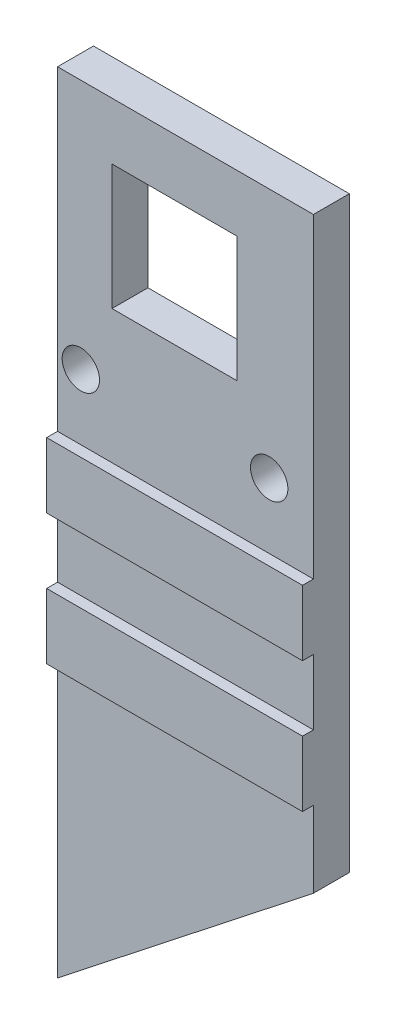
ISO-10303-21;
HEADER;
FILE_DESCRIPTION(('STEP AP214'),'2;1');
FILE_NAME('part.step','',(''),(''),'','','');
FILE_SCHEMA(('AUTOMOTIVE_DESIGN { 1 0 10303 214 1 1 1 1 }'));
ENDSEC;
DATA;
#1=APPLICATION_CONTEXT('core data for automotive mechanical design processes');
#2=APPLICATION_PROTOCOL_DEFINITION('international standard','automotive_design',2000,#1);
#3=PRODUCT_CONTEXT('',#1,'mechanical');
#4=PRODUCT('Part','Part','',(#3));
#5=PRODUCT_RELATED_PRODUCT_CATEGORY('part','',(#4));
#6=PRODUCT_DEFINITION_FORMATION('','',#4);
#7=PRODUCT_DEFINITION_CONTEXT('part definition',#1,'design');
#8=PRODUCT_DEFINITION('design','',#6,#7);
#9=PRODUCT_DEFINITION_SHAPE('','',#8);
#10=(LENGTH_UNIT() NAMED_UNIT(*) SI_UNIT(.MILLI.,.METRE.));
#11=(NAMED_UNIT(*) PLANE_ANGLE_UNIT() SI_UNIT($,.RADIAN.));
#12=(NAMED_UNIT(*) SI_UNIT($,.STERADIAN.) SOLID_ANGLE_UNIT());
#13=UNCERTAINTY_MEASURE_WITH_UNIT(LENGTH_MEASURE(1.E-05),#10,'distance_accuracy_value','');
#14=(GEOMETRIC_REPRESENTATION_CONTEXT(3) GLOBAL_UNCERTAINTY_ASSIGNED_CONTEXT((#13)) GLOBAL_UNIT_ASSIGNED_CONTEXT((#10,
#11,#12)) REPRESENTATION_CONTEXT('',''));
#15=CARTESIAN_POINT('',(0.,0.,0.));
#16=DIRECTION('',(0.,0.,1.));
#17=DIRECTION('',(1.,0.,0.));
#18=AXIS2_PLACEMENT_3D('',#15,#16,#17);
#19=CARTESIAN_POINT('',(0.,0.,3.3));
#20=DIRECTION('',(0.,0.,1.));
#21=DIRECTION('',(1.,0.,0.));
#22=AXIS2_PLACEMENT_3D('',#19,#20,#21);
#23=PLANE('',#22);
#24=DIRECTION('',(0.,1.,0.));
#25=VECTOR('',#24,1.);
#26=CARTESIAN_POINT('',(-10.7877192602988,0.,3.3));
#27=LINE('',#26,#25);
#28=CARTESIAN_POINT('',(-10.7877192602988,-39.3203194861106,3.3));
#29=VERTEX_POINT('',#28);
#30=CARTESIAN_POINT('',(-10.7877192602988,-13.8338220830736,3.3));
#31=VERTEX_POINT('',#30);
#32=EDGE_CURVE('E291',#29,#31,#27,.T.);
#33=ORIENTED_EDGE('',*,*,#32,.F.);
#34=DIRECTION('',(0.785948961590541,0.618291379346947,0.));
#35=VECTOR('',#34,1.);
#36=CARTESIAN_POINT('',(-15.2539528353899,-42.8338220830736,3.3));
#37=LINE('',#36,#35);
#38=CARTESIAN_POINT('',(12.7122807397012,-20.8333080836795,3.3));
#39=VERTEX_POINT('',#38);
#40=EDGE_CURVE('E251',#29,#39,#37,.T.);
#41=ORIENTED_EDGE('',*,*,#40,.T.);
#42=DIRECTION('',(0.,-1.,0.));
#43=VECTOR('',#42,1.);
#44=CARTESIAN_POINT('',(12.7122807397012,0.,3.3));
#45=LINE('',#44,#43);
#46=CARTESIAN_POINT('',(12.7122807397012,-13.8338220830736,3.3));
#47=VERTEX_POINT('',#46);
#48=EDGE_CURVE('E61',#47,#39,#45,.T.);
#49=ORIENTED_EDGE('',*,*,#48,.F.);
#50=DIRECTION('',(1.,0.,0.));
#51=VECTOR('',#50,1.);
#52=CARTESIAN_POINT('',(-15.2539528353899,-13.8338220830736,3.3));
#53=LINE('',#52,#51);
#54=EDGE_CURVE('E188',#31,#47,#53,.T.);
#55=ORIENTED_EDGE('',*,*,#54,.F.);
#56=EDGE_LOOP('',(#33,#41,#49,#55));
#57=FACE_BOUND('',#56,.T.);
#58=ADVANCED_FACE('F39',(#57),#23,.T.);
#59=CARTESIAN_POINT('',(0.,0.,0.));
#60=DIRECTION('',(0.,0.,1.));
#61=DIRECTION('',(1.,0.,0.));
#62=AXIS2_PLACEMENT_3D('',#59,#60,#61);
#63=PLANE('',#62);
#64=DIRECTION('',(1.,0.,0.));
#65=VECTOR('',#64,1.);
#66=CARTESIAN_POINT('',(0.,27.9318613374807,0.));
#67=LINE('',#66,#65);
#68=CARTESIAN_POINT('',(-5.78771926029876,27.9318613374807,0.));
#69=VERTEX_POINT('',#68);
#70=CARTESIAN_POINT('',(5.71228073970124,27.9318613374807,0.));
#71=VERTEX_POINT('',#70);
#72=EDGE_CURVE('E176',#69,#71,#67,.T.);
#73=ORIENTED_EDGE('',*,*,#72,.F.);
#74=DIRECTION('',(0.,-1.,0.));
#75=VECTOR('',#74,1.);
#76=CARTESIAN_POINT('',(-5.78771926029876,0.,0.));
#77=LINE('',#76,#75);
#78=CARTESIAN_POINT('',(-5.78771926029876,16.4318613374807,0.));
#79=VERTEX_POINT('',#78);
#80=EDGE_CURVE('E217',#69,#79,#77,.T.);
#81=ORIENTED_EDGE('',*,*,#80,.T.);
#82=DIRECTION('',(1.,0.,0.));
#83=VECTOR('',#82,1.);
#84=CARTESIAN_POINT('',(0.,16.4318613374807,0.));
#85=LINE('',#84,#83);
#86=CARTESIAN_POINT('',(5.71228073970124,16.4318613374807,0.));
#87=VERTEX_POINT('',#86);
#88=EDGE_CURVE('E214',#79,#87,#85,.T.);
#89=ORIENTED_EDGE('',*,*,#88,.T.);
#90=DIRECTION('',(0.,-1.,0.));
#91=VECTOR('',#90,1.);
#92=CARTESIAN_POINT('',(5.71228073970124,0.,0.));
#93=LINE('',#92,#91);
#94=EDGE_CURVE('E179',#71,#87,#93,.T.);
#95=ORIENTED_EDGE('',*,*,#94,.F.);
#96=EDGE_LOOP('',(#73,#81,#89,#95));
#97=FACE_BOUND('',#96,.T.);
#98=CARTESIAN_POINT('',(-8.65,10.1661779169264,0.));
#99=DIRECTION('',(0.,0.,1.));
#100=DIRECTION('',(1.,0.,0.));
#101=AXIS2_PLACEMENT_3D('',#98,#99,#100);
#102=CIRCLE('',#101,1.71606969398137);
#103=CARTESIAN_POINT('',(-6.93393030601863,10.1661779169264,0.));
#104=VERTEX_POINT('',#103);
#105=EDGE_CURVE('E223',#104,#104,#102,.T.);
#106=ORIENTED_EDGE('',*,*,#105,.T.);
#107=EDGE_LOOP('',(#106));
#108=FACE_BOUND('',#107,.T.);
#109=CARTESIAN_POINT('',(8.65,10.1661779169264,0.));
#110=DIRECTION('',(0.,0.,1.));
#111=DIRECTION('',(1.,0.,0.));
#112=AXIS2_PLACEMENT_3D('',#109,#110,#111);
#113=CIRCLE('',#112,1.71606969398137);
#114=CARTESIAN_POINT('',(10.3660696939814,10.1661779169264,0.));
#115=VERTEX_POINT('',#114);
#116=EDGE_CURVE('E194',#115,#115,#113,.F.);
#117=ORIENTED_EDGE('',*,*,#116,.F.);
#118=EDGE_LOOP('',(#117));
#119=FACE_BOUND('',#118,.T.);
#120=DIRECTION('',(0.785948961590541,0.618291379346947,0.));
#121=VECTOR('',#120,1.);
#122=CARTESIAN_POINT('',(-15.2539528353899,-42.8338220830736,0.));
#123=LINE('',#122,#121);
#124=CARTESIAN_POINT('',(-10.7877192602988,-39.3203194861106,0.));
#125=VERTEX_POINT('',#124);
#126=CARTESIAN_POINT('',(12.7122807397012,-20.8333080836795,0.));
#127=VERTEX_POINT('',#126);
#128=EDGE_CURVE('E245',#125,#127,#123,.T.);
#129=ORIENTED_EDGE('',*,*,#128,.F.);
#130=DIRECTION('',(0.,1.,0.));
#131=VECTOR('',#130,1.);
#132=CARTESIAN_POINT('',(-10.7877192602988,0.,0.));
#133=LINE('',#132,#131);
#134=CARTESIAN_POINT('',(-10.7877192602988,33.1661779169264,0.));
#135=VERTEX_POINT('',#134);
#136=EDGE_CURVE('E53',#125,#135,#133,.T.);
#137=ORIENTED_EDGE('',*,*,#136,.T.);
#138=DIRECTION('',(1.,0.,0.));
#139=VECTOR('',#138,1.);
#140=CARTESIAN_POINT('',(0.,33.1661779169264,0.));
#141=LINE('',#140,#139);
#142=CARTESIAN_POINT('',(12.7122807397012,33.1661779169264,0.));
#143=VERTEX_POINT('',#142);
#144=EDGE_CURVE('E220',#135,#143,#141,.T.);
#145=ORIENTED_EDGE('',*,*,#144,.T.);
#146=DIRECTION('',(0.,-1.,0.));
#147=VECTOR('',#146,1.);
#148=CARTESIAN_POINT('',(12.7122807397012,0.,0.));
#149=LINE('',#148,#147);
#150=EDGE_CURVE('E236',#143,#127,#149,.T.);
#151=ORIENTED_EDGE('',*,*,#150,.T.);
#152=EDGE_LOOP('',(#129,#137,#145,#151));
#153=FACE_BOUND('',#152,.T.);
#154=ADVANCED_FACE('F244',(#97,#108,#119,#153),#63,.F.);
#155=DIRECTION('',(0.,1.,0.));
#156=VECTOR('',#155,1.);
#157=CARTESIAN_POINT('',(-10.7877192602988,0.,3.3));
#158=LINE('',#157,#156);
#159=CARTESIAN_POINT('',(-10.7877192602988,-7.83382208307362,3.3));
#160=VERTEX_POINT('',#159);
#161=CARTESIAN_POINT('',(-10.7877192602988,-1.83382208307362,3.3));
#162=VERTEX_POINT('',#161);
#163=EDGE_CURVE('E297',#160,#162,#158,.T.);
#164=ORIENTED_EDGE('',*,*,#163,.F.);
#165=DIRECTION('',(-1.,0.,0.));
#166=VECTOR('',#165,1.);
#167=CARTESIAN_POINT('',(-15.2539528353899,-7.83382208307362,3.3));
#168=LINE('',#167,#166);
#169=CARTESIAN_POINT('',(12.7122807397012,-7.83382208307362,3.3));
#170=VERTEX_POINT('',#169);
#171=EDGE_CURVE('E261',#170,#160,#168,.T.);
#172=ORIENTED_EDGE('',*,*,#171,.F.);
#173=DIRECTION('',(0.,-1.,0.));
#174=VECTOR('',#173,1.);
#175=CARTESIAN_POINT('',(12.7122807397012,0.,3.3));
#176=LINE('',#175,#174);
#177=CARTESIAN_POINT('',(12.7122807397012,-1.83382208307362,3.3));
#178=VERTEX_POINT('',#177);
#179=EDGE_CURVE('E283',#178,#170,#176,.T.);
#180=ORIENTED_EDGE('',*,*,#179,.F.);
#181=DIRECTION('',(1.,0.,0.));
#182=VECTOR('',#181,1.);
#183=CARTESIAN_POINT('',(-15.2539528353899,-1.83382208307362,3.3));
#184=LINE('',#183,#182);
#185=EDGE_CURVE('E185',#162,#178,#184,.T.);
#186=ORIENTED_EDGE('',*,*,#185,.F.);
#187=EDGE_LOOP('',(#164,#172,#180,#186));
#188=FACE_BOUND('',#187,.T.);
#189=ADVANCED_FACE('F312',(#188),#23,.T.);
#190=DIRECTION('',(0.,1.,0.));
#191=VECTOR('',#190,1.);
#192=CARTESIAN_POINT('',(-10.7877192602988,0.,3.3));
#193=LINE('',#192,#191);
#194=CARTESIAN_POINT('',(-10.7877192602988,4.16617791692638,3.3));
#195=VERTEX_POINT('',#194);
#196=CARTESIAN_POINT('',(-10.7877192602988,33.1661779169264,3.3));
#197=VERTEX_POINT('',#196);
#198=EDGE_CURVE('E256',#195,#197,#193,.T.);
#199=ORIENTED_EDGE('',*,*,#198,.F.);
#200=DIRECTION('',(-1.,0.,0.));
#201=VECTOR('',#200,1.);
#202=CARTESIAN_POINT('',(-15.2539528353899,4.16617791692638,3.3));
#203=LINE('',#202,#201);
#204=CARTESIAN_POINT('',(12.7122807397012,4.16617791692637,3.3));
#205=VERTEX_POINT('',#204);
#206=EDGE_CURVE('E181',#205,#195,#203,.T.);
#207=ORIENTED_EDGE('',*,*,#206,.F.);
#208=DIRECTION('',(0.,-1.,0.));
#209=VECTOR('',#208,1.);
#210=CARTESIAN_POINT('',(12.7122807397012,0.,3.3));
#211=LINE('',#210,#209);
#212=CARTESIAN_POINT('',(12.7122807397012,33.1661779169264,3.3));
#213=VERTEX_POINT('',#212);
#214=EDGE_CURVE('E155',#213,#205,#211,.T.);
#215=ORIENTED_EDGE('',*,*,#214,.F.);
#216=DIRECTION('',(1.,0.,0.));
#217=VECTOR('',#216,1.);
#218=CARTESIAN_POINT('',(0.,33.1661779169264,3.3));
#219=LINE('',#218,#217);
#220=EDGE_CURVE('E202',#197,#213,#219,.T.);
#221=ORIENTED_EDGE('',*,*,#220,.F.);
#222=EDGE_LOOP('',(#199,#207,#215,#221));
#223=FACE_BOUND('',#222,.T.);
#224=CARTESIAN_POINT('',(8.65,10.1661779169264,3.3));
#225=DIRECTION('',(0.,0.,1.));
#226=DIRECTION('',(1.,0.,0.));
#227=AXIS2_PLACEMENT_3D('',#224,#225,#226);
#228=CIRCLE('',#227,1.71606969398137);
#229=CARTESIAN_POINT('',(10.3660696939814,10.1661779169264,3.3));
#230=VERTEX_POINT('',#229);
#231=EDGE_CURVE('E208',#230,#230,#228,.F.);
#232=ORIENTED_EDGE('',*,*,#231,.T.);
#233=EDGE_LOOP('',(#232));
#234=FACE_BOUND('',#233,.T.);
#235=CARTESIAN_POINT('',(-8.65,10.1661779169264,3.3));
#236=DIRECTION('',(0.,0.,1.));
#237=DIRECTION('',(1.,0.,0.));
#238=AXIS2_PLACEMENT_3D('',#235,#236,#237);
#239=CIRCLE('',#238,1.71606969398137);
#240=CARTESIAN_POINT('',(-6.93393030601863,10.1661779169264,3.3));
#241=VERTEX_POINT('',#240);
#242=EDGE_CURVE('E205',#241,#241,#239,.T.);
#243=ORIENTED_EDGE('',*,*,#242,.F.);
#244=EDGE_LOOP('',(#243));
#245=FACE_BOUND('',#244,.T.);
#246=DIRECTION('',(1.,0.,0.));
#247=VECTOR('',#246,1.);
#248=CARTESIAN_POINT('',(0.,27.9318613374807,3.3));
#249=LINE('',#248,#247);
#250=CARTESIAN_POINT('',(-5.78771926029876,27.9318613374807,3.3));
#251=VERTEX_POINT('',#250);
#252=CARTESIAN_POINT('',(5.71228073970124,27.9318613374807,3.3));
#253=VERTEX_POINT('',#252);
#254=EDGE_CURVE('E190',#251,#253,#249,.T.);
#255=ORIENTED_EDGE('',*,*,#254,.T.);
#256=DIRECTION('',(0.,-1.,0.));
#257=VECTOR('',#256,1.);
#258=CARTESIAN_POINT('',(5.71228073970124,0.,3.3));
#259=LINE('',#258,#257);
#260=CARTESIAN_POINT('',(5.71228073970124,16.4318613374807,3.3));
#261=VERTEX_POINT('',#260);
#262=EDGE_CURVE('E193',#253,#261,#259,.T.);
#263=ORIENTED_EDGE('',*,*,#262,.T.);
#264=DIRECTION('',(1.,0.,0.));
#265=VECTOR('',#264,1.);
#266=CARTESIAN_POINT('',(0.,16.4318613374807,3.3));
#267=LINE('',#266,#265);
#268=CARTESIAN_POINT('',(-5.78771926029876,16.4318613374807,3.3));
#269=VERTEX_POINT('',#268);
#270=EDGE_CURVE('E196',#269,#261,#267,.T.);
#271=ORIENTED_EDGE('',*,*,#270,.F.);
#272=DIRECTION('',(0.,-1.,0.));
#273=VECTOR('',#272,1.);
#274=CARTESIAN_POINT('',(-5.78771926029876,0.,3.3));
#275=LINE('',#274,#273);
#276=EDGE_CURVE('E199',#251,#269,#275,.T.);
#277=ORIENTED_EDGE('',*,*,#276,.F.);
#278=EDGE_LOOP('',(#255,#263,#271,#277));
#279=FACE_BOUND('',#278,.T.);
#280=ADVANCED_FACE('F309',(#223,#234,#245,#279),#23,.T.);
#281=CARTESIAN_POINT('',(0.,33.1661779169264,3.3));
#282=DIRECTION('',(0.,1.,0.));
#283=DIRECTION('',(0.,0.,1.));
#284=AXIS2_PLACEMENT_3D('',#281,#282,#283);
#285=PLANE('',#284);
#286=DIRECTION('',(0.,0.,1.));
#287=VECTOR('',#286,1.);
#288=CARTESIAN_POINT('',(-10.7877192602988,33.1661779169264,-7.));
#289=LINE('',#288,#287);
#290=EDGE_CURVE('E247',#135,#197,#289,.T.);
#291=ORIENTED_EDGE('',*,*,#290,.T.);
#292=ORIENTED_EDGE('',*,*,#220,.T.);
#293=DIRECTION('',(0.,0.,1.));
#294=VECTOR('',#293,1.);
#295=CARTESIAN_POINT('',(12.7122807397012,33.1661779169264,-7.));
#296=LINE('',#295,#294);
#297=EDGE_CURVE('E372',#143,#213,#296,.T.);
#298=ORIENTED_EDGE('',*,*,#297,.F.);
#299=ORIENTED_EDGE('',*,*,#144,.F.);
#300=EDGE_LOOP('',(#291,#292,#298,#299));
#301=FACE_BOUND('',#300,.T.);
#302=ADVANCED_FACE('F307',(#301),#285,.T.);
#303=CARTESIAN_POINT('',(0.,27.9318613374807,3.3));
#304=DIRECTION('',(0.,1.,0.));
#305=DIRECTION('',(0.,0.,1.));
#306=AXIS2_PLACEMENT_3D('',#303,#304,#305);
#307=PLANE('',#306);
#308=ORIENTED_EDGE('',*,*,#72,.T.);
#309=DIRECTION('',(0.,0.,-1.));
#310=VECTOR('',#309,1.);
#311=CARTESIAN_POINT('',(5.71228073970124,27.9318613374807,3.3));
#312=LINE('',#311,#310);
#313=EDGE_CURVE('E233',#253,#71,#312,.T.);
#314=ORIENTED_EDGE('',*,*,#313,.F.);
#315=ORIENTED_EDGE('',*,*,#254,.F.);
#316=DIRECTION('',(0.,0.,-1.));
#317=VECTOR('',#316,1.);
#318=CARTESIAN_POINT('',(-5.78771926029876,27.9318613374807,3.3));
#319=LINE('',#318,#317);
#320=EDGE_CURVE('E210',#251,#69,#319,.T.);
#321=ORIENTED_EDGE('',*,*,#320,.T.);
#322=EDGE_LOOP('',(#308,#314,#315,#321));
#323=FACE_BOUND('',#322,.T.);
#324=ADVANCED_FACE('F41',(#323),#307,.F.);
#325=CARTESIAN_POINT('',(5.71228073970124,0.,3.3));
#326=DIRECTION('',(1.,0.,0.));
#327=DIRECTION('',(0.,0.,-1.));
#328=AXIS2_PLACEMENT_3D('',#325,#326,#327);
#329=PLANE('',#328);
#330=ORIENTED_EDGE('',*,*,#94,.T.);
#331=DIRECTION('',(0.,0.,-1.));
#332=VECTOR('',#331,1.);
#333=CARTESIAN_POINT('',(5.71228073970124,16.4318613374807,3.3));
#334=LINE('',#333,#332);
#335=EDGE_CURVE('E231',#261,#87,#334,.T.);
#336=ORIENTED_EDGE('',*,*,#335,.F.);
#337=ORIENTED_EDGE('',*,*,#262,.F.);
#338=ORIENTED_EDGE('',*,*,#313,.T.);
#339=EDGE_LOOP('',(#330,#336,#337,#338));
#340=FACE_BOUND('',#339,.T.);
#341=ADVANCED_FACE('F326',(#340),#329,.F.);
#342=CARTESIAN_POINT('',(0.,16.4318613374807,3.3));
#343=DIRECTION('',(0.,1.,0.));
#344=DIRECTION('',(0.,0.,1.));
#345=AXIS2_PLACEMENT_3D('',#342,#343,#344);
#346=PLANE('',#345);
#347=ORIENTED_EDGE('',*,*,#88,.F.);
#348=DIRECTION('',(0.,0.,-1.));
#349=VECTOR('',#348,1.);
#350=CARTESIAN_POINT('',(-5.78771926029876,16.4318613374807,3.3));
#351=LINE('',#350,#349);
#352=EDGE_CURVE('E229',#269,#79,#351,.T.);
#353=ORIENTED_EDGE('',*,*,#352,.F.);
#354=ORIENTED_EDGE('',*,*,#270,.T.);
#355=ORIENTED_EDGE('',*,*,#335,.T.);
#356=EDGE_LOOP('',(#347,#353,#354,#355));
#357=FACE_BOUND('',#356,.T.);
#358=ADVANCED_FACE('F329',(#357),#346,.T.);
#359=CARTESIAN_POINT('',(-8.65,10.1661779169264,3.3));
#360=DIRECTION('',(0.,0.,-1.));
#361=DIRECTION('',(-1.,0.,0.));
#362=AXIS2_PLACEMENT_3D('',#359,#360,#361);
#363=CYLINDRICAL_SURFACE('',#362,1.71606969398137);
#364=ORIENTED_EDGE('',*,*,#242,.T.);
#365=EDGE_LOOP('',(#364));
#366=FACE_BOUND('',#365,.T.);
#367=ORIENTED_EDGE('',*,*,#105,.F.);
#368=EDGE_LOOP('',(#367));
#369=FACE_BOUND('',#368,.T.);
#370=ADVANCED_FACE('F352',(#366,#369),#363,.F.);
#371=CARTESIAN_POINT('',(-5.78771926029876,0.,3.3));
#372=DIRECTION('',(1.,0.,0.));
#373=DIRECTION('',(0.,0.,-1.));
#374=AXIS2_PLACEMENT_3D('',#371,#372,#373);
#375=PLANE('',#374);
#376=ORIENTED_EDGE('',*,*,#80,.F.);
#377=ORIENTED_EDGE('',*,*,#320,.F.);
#378=ORIENTED_EDGE('',*,*,#276,.T.);
#379=ORIENTED_EDGE('',*,*,#352,.T.);
#380=EDGE_LOOP('',(#376,#377,#378,#379));
#381=FACE_BOUND('',#380,.T.);
#382=ADVANCED_FACE('F332',(#381),#375,.T.);
#383=CARTESIAN_POINT('',(8.65,10.1661779169264,3.3));
#384=DIRECTION('',(0.,0.,-1.));
#385=DIRECTION('',(-1.,0.,0.));
#386=AXIS2_PLACEMENT_3D('',#383,#384,#385);
#387=CYLINDRICAL_SURFACE('',#386,1.71606969398137);
#388=ORIENTED_EDGE('',*,*,#231,.F.);
#389=EDGE_LOOP('',(#388));
#390=FACE_BOUND('',#389,.T.);
#391=ORIENTED_EDGE('',*,*,#116,.T.);
#392=EDGE_LOOP('',(#391));
#393=FACE_BOUND('',#392,.T.);
#394=ADVANCED_FACE('F341',(#390,#393),#387,.F.);
#395=CARTESIAN_POINT('',(-15.2539528353899,-1.83382208307362,4.3));
#396=DIRECTION('',(0.,1.,0.));
#397=DIRECTION('',(-1.,0.,0.));
#398=AXIS2_PLACEMENT_3D('',#395,#396,#397);
#399=PLANE('',#398);
#400=DIRECTION('',(1.,0.,0.));
#401=VECTOR('',#400,1.);
#402=CARTESIAN_POINT('',(-15.2539528353899,-1.83382208307362,4.3));
#403=LINE('',#402,#401);
#404=CARTESIAN_POINT('',(-10.7877192602988,-1.83382208307361,4.3));
#405=VERTEX_POINT('',#404);
#406=CARTESIAN_POINT('',(12.7122807397012,-1.83382208307362,4.3));
#407=VERTEX_POINT('',#406);
#408=EDGE_CURVE('E169',#405,#407,#403,.T.);
#409=ORIENTED_EDGE('',*,*,#408,.F.);
#410=DIRECTION('',(0.,0.,-1.));
#411=VECTOR('',#410,1.);
#412=CARTESIAN_POINT('',(-10.7877192602988,-1.83382208307362,4.3));
#413=LINE('',#412,#411);
#414=EDGE_CURVE('E299',#405,#162,#413,.T.);
#415=ORIENTED_EDGE('',*,*,#414,.T.);
#416=ORIENTED_EDGE('',*,*,#185,.T.);
#417=DIRECTION('',(0.,0.,1.));
#418=VECTOR('',#417,1.);
#419=CARTESIAN_POINT('',(12.7122807397012,-1.83382208307362,4.3));
#420=LINE('',#419,#418);
#421=EDGE_CURVE('E160',#178,#407,#420,.T.);
#422=ORIENTED_EDGE('',*,*,#421,.T.);
#423=EDGE_LOOP('',(#409,#415,#416,#422));
#424=FACE_BOUND('',#423,.T.);
#425=ADVANCED_FACE('F343',(#424),#399,.F.);
#426=CARTESIAN_POINT('',(-15.2539528353899,4.16617791692638,4.3));
#427=DIRECTION('',(0.,-1.,0.));
#428=DIRECTION('',(1.,0.,0.));
#429=AXIS2_PLACEMENT_3D('',#426,#427,#428);
#430=PLANE('',#429);
#431=ORIENTED_EDGE('',*,*,#206,.T.);
#432=DIRECTION('',(0.,0.,1.));
#433=VECTOR('',#432,1.);
#434=CARTESIAN_POINT('',(-10.7877192602988,4.16617791692638,4.3));
#435=LINE('',#434,#433);
#436=CARTESIAN_POINT('',(-10.7877192602988,4.16617791692638,4.3));
#437=VERTEX_POINT('',#436);
#438=EDGE_CURVE('E175',#195,#437,#435,.T.);
#439=ORIENTED_EDGE('',*,*,#438,.T.);
#440=DIRECTION('',(-1.,0.,0.));
#441=VECTOR('',#440,1.);
#442=CARTESIAN_POINT('',(-15.2539528353899,4.16617791692638,4.3));
#443=LINE('',#442,#441);
#444=CARTESIAN_POINT('',(12.7122807397012,4.16617791692638,4.3));
#445=VERTEX_POINT('',#444);
#446=EDGE_CURVE('E167',#445,#437,#443,.T.);
#447=ORIENTED_EDGE('',*,*,#446,.F.);
#448=DIRECTION('',(0.,0.,-1.));
#449=VECTOR('',#448,1.);
#450=CARTESIAN_POINT('',(12.7122807397012,4.16617791692637,4.3));
#451=LINE('',#450,#449);
#452=EDGE_CURVE('E149',#445,#205,#451,.T.);
#453=ORIENTED_EDGE('',*,*,#452,.T.);
#454=EDGE_LOOP('',(#431,#439,#447,#453));
#455=FACE_BOUND('',#454,.T.);
#456=ADVANCED_FACE('F174',(#455),#430,.F.);
#457=CARTESIAN_POINT('',(0.,0.,4.3));
#458=DIRECTION('',(0.,0.,1.));
#459=DIRECTION('',(1.,0.,0.));
#460=AXIS2_PLACEMENT_3D('',#457,#458,#459);
#461=PLANE('',#460);
#462=DIRECTION('',(0.,1.,0.));
#463=VECTOR('',#462,1.);
#464=CARTESIAN_POINT('',(-10.7877192602988,33.1661779169264,4.3));
#465=LINE('',#464,#463);
#466=EDGE_CURVE('E170',#405,#437,#465,.T.);
#467=ORIENTED_EDGE('',*,*,#466,.F.);
#468=ORIENTED_EDGE('',*,*,#408,.T.);
#469=DIRECTION('',(0.,-1.,0.));
#470=VECTOR('',#469,1.);
#471=CARTESIAN_POINT('',(12.7122807397012,33.1661779169264,4.3));
#472=LINE('',#471,#470);
#473=EDGE_CURVE('E152',#445,#407,#472,.T.);
#474=ORIENTED_EDGE('',*,*,#473,.F.);
#475=ORIENTED_EDGE('',*,*,#446,.T.);
#476=EDGE_LOOP('',(#467,#468,#474,#475));
#477=FACE_BOUND('',#476,.T.);
#478=ADVANCED_FACE('F166',(#477),#461,.T.);
#479=CARTESIAN_POINT('',(-15.2539528353899,-13.8338220830736,4.3));
#480=DIRECTION('',(0.,1.,0.));
#481=DIRECTION('',(-1.,0.,0.));
#482=AXIS2_PLACEMENT_3D('',#479,#480,#481);
#483=PLANE('',#482);
#484=DIRECTION('',(1.,0.,0.));
#485=VECTOR('',#484,1.);
#486=CARTESIAN_POINT('',(-15.2539528353899,-13.8338220830736,4.3));
#487=LINE('',#486,#485);
#488=CARTESIAN_POINT('',(-10.7877192602988,-13.8338220830736,4.3));
#489=VERTEX_POINT('',#488);
#490=CARTESIAN_POINT('',(12.7122807397012,-13.8338220830736,4.3));
#491=VERTEX_POINT('',#490);
#492=EDGE_CURVE('E254',#489,#491,#487,.T.);
#493=ORIENTED_EDGE('',*,*,#492,.F.);
#494=DIRECTION('',(0.,0.,-1.));
#495=VECTOR('',#494,1.);
#496=CARTESIAN_POINT('',(-10.7877192602988,-13.8338220830736,4.3));
#497=LINE('',#496,#495);
#498=EDGE_CURVE('E277',#489,#31,#497,.T.);
#499=ORIENTED_EDGE('',*,*,#498,.T.);
#500=ORIENTED_EDGE('',*,*,#54,.T.);
#501=DIRECTION('',(0.,0.,1.));
#502=VECTOR('',#501,1.);
#503=CARTESIAN_POINT('',(12.7122807397012,-13.8338220830736,4.3));
#504=LINE('',#503,#502);
#505=EDGE_CURVE('E279',#47,#491,#504,.T.);
#506=ORIENTED_EDGE('',*,*,#505,.T.);
#507=EDGE_LOOP('',(#493,#499,#500,#506));
#508=FACE_BOUND('',#507,.T.);
#509=ADVANCED_FACE('F276',(#508),#483,.F.);
#510=CARTESIAN_POINT('',(-15.2539528353899,-7.83382208307362,4.3));
#511=DIRECTION('',(0.,-1.,0.));
#512=DIRECTION('',(0.,0.,-1.));
#513=AXIS2_PLACEMENT_3D('',#510,#511,#512);
#514=PLANE('',#513);
#515=ORIENTED_EDGE('',*,*,#171,.T.);
#516=DIRECTION('',(0.,0.,1.));
#517=VECTOR('',#516,1.);
#518=CARTESIAN_POINT('',(-10.7877192602988,-7.83382208307362,4.3));
#519=LINE('',#518,#517);
#520=CARTESIAN_POINT('',(-10.7877192602988,-7.83382208307361,4.3));
#521=VERTEX_POINT('',#520);
#522=EDGE_CURVE('E294',#160,#521,#519,.T.);
#523=ORIENTED_EDGE('',*,*,#522,.T.);
#524=DIRECTION('',(-1.,0.,0.));
#525=VECTOR('',#524,1.);
#526=CARTESIAN_POINT('',(-15.2539528353899,-7.83382208307362,4.3));
#527=LINE('',#526,#525);
#528=CARTESIAN_POINT('',(12.7122807397012,-7.83382208307362,4.3));
#529=VERTEX_POINT('',#528);
#530=EDGE_CURVE('E250',#529,#521,#527,.T.);
#531=ORIENTED_EDGE('',*,*,#530,.F.);
#532=DIRECTION('',(0.,0.,-1.));
#533=VECTOR('',#532,1.);
#534=CARTESIAN_POINT('',(12.7122807397012,-7.83382208307362,4.3));
#535=LINE('',#534,#533);
#536=EDGE_CURVE('E280',#529,#170,#535,.T.);
#537=ORIENTED_EDGE('',*,*,#536,.T.);
#538=EDGE_LOOP('',(#515,#523,#531,#537));
#539=FACE_BOUND('',#538,.T.);
#540=ADVANCED_FACE('F369',(#539),#514,.F.);
#541=CARTESIAN_POINT('',(0.,0.,4.3));
#542=DIRECTION('',(0.,0.,1.));
#543=DIRECTION('',(1.,0.,0.));
#544=AXIS2_PLACEMENT_3D('',#541,#542,#543);
#545=PLANE('',#544);
#546=EDGE_CURVE('E272',#489,#521,#465,.T.);
#547=ORIENTED_EDGE('',*,*,#546,.F.);
#548=ORIENTED_EDGE('',*,*,#492,.T.);
#549=EDGE_CURVE('E171',#529,#491,#472,.T.);
#550=ORIENTED_EDGE('',*,*,#549,.F.);
#551=ORIENTED_EDGE('',*,*,#530,.T.);
#552=EDGE_LOOP('',(#547,#548,#550,#551));
#553=FACE_BOUND('',#552,.T.);
#554=ADVANCED_FACE('F270',(#553),#545,.T.);
#555=CARTESIAN_POINT('',(-15.2539528353899,-42.8338220830736,0.));
#556=DIRECTION('',(0.618291379346947,-0.785948961590541,0.));
#557=DIRECTION('',(0.785948961590541,0.618291379346947,0.));
#558=AXIS2_PLACEMENT_3D('',#555,#556,#557);
#559=PLANE('',#558);
#560=DIRECTION('',(0.,0.,1.));
#561=VECTOR('',#560,1.);
#562=CARTESIAN_POINT('',(-10.7877192602988,-39.3203194861106,0.));
#563=LINE('',#562,#561);
#564=EDGE_CURVE('E11',#125,#29,#563,.T.);
#565=ORIENTED_EDGE('',*,*,#564,.F.);
#566=ORIENTED_EDGE('',*,*,#128,.T.);
#567=DIRECTION('',(0.,0.,-1.));
#568=VECTOR('',#567,1.);
#569=CARTESIAN_POINT('',(12.7122807397012,-20.8333080836795,0.));
#570=LINE('',#569,#568);
#571=EDGE_CURVE('E47',#39,#127,#570,.T.);
#572=ORIENTED_EDGE('',*,*,#571,.F.);
#573=ORIENTED_EDGE('',*,*,#40,.F.);
#574=EDGE_LOOP('',(#565,#566,#572,#573));
#575=FACE_BOUND('',#574,.T.);
#576=ADVANCED_FACE('F249',(#575),#559,.T.);
#577=CARTESIAN_POINT('',(12.7122807397012,33.1661779169264,-7.));
#578=DIRECTION('',(-1.,0.,0.));
#579=DIRECTION('',(0.,-1.,0.));
#580=AXIS2_PLACEMENT_3D('',#577,#578,#579);
#581=PLANE('',#580);
#582=ORIENTED_EDGE('',*,*,#214,.T.);
#583=ORIENTED_EDGE('',*,*,#452,.F.);
#584=ORIENTED_EDGE('',*,*,#473,.T.);
#585=ORIENTED_EDGE('',*,*,#421,.F.);
#586=ORIENTED_EDGE('',*,*,#179,.T.);
#587=ORIENTED_EDGE('',*,*,#536,.F.);
#588=ORIENTED_EDGE('',*,*,#549,.T.);
#589=ORIENTED_EDGE('',*,*,#505,.F.);
#590=ORIENTED_EDGE('',*,*,#48,.T.);
#591=ORIENTED_EDGE('',*,*,#571,.T.);
#592=ORIENTED_EDGE('',*,*,#150,.F.);
#593=ORIENTED_EDGE('',*,*,#297,.T.);
#594=EDGE_LOOP('',(#582,#583,#584,#585,#586,#587,#588,#589,#590,#591,#592,#593));
#595=FACE_BOUND('',#594,.T.);
#596=ADVANCED_FACE('F151',(#595),#581,.F.);
#597=CARTESIAN_POINT('',(-10.7877192602988,33.1661779169264,-7.));
#598=DIRECTION('',(1.,0.,0.));
#599=DIRECTION('',(0.,1.,0.));
#600=AXIS2_PLACEMENT_3D('',#597,#598,#599);
#601=PLANE('',#600);
#602=ORIENTED_EDGE('',*,*,#198,.T.);
#603=ORIENTED_EDGE('',*,*,#290,.F.);
#604=ORIENTED_EDGE('',*,*,#136,.F.);
#605=ORIENTED_EDGE('',*,*,#564,.T.);
#606=ORIENTED_EDGE('',*,*,#32,.T.);
#607=ORIENTED_EDGE('',*,*,#498,.F.);
#608=ORIENTED_EDGE('',*,*,#546,.T.);
#609=ORIENTED_EDGE('',*,*,#522,.F.);
#610=ORIENTED_EDGE('',*,*,#163,.T.);
#611=ORIENTED_EDGE('',*,*,#414,.F.);
#612=ORIENTED_EDGE('',*,*,#466,.T.);
#613=ORIENTED_EDGE('',*,*,#438,.F.);
#614=EDGE_LOOP('',(#602,#603,#604,#605,#606,#607,#608,#609,#610,#611,#612,#613));
#615=FACE_BOUND('',#614,.T.);
#616=ADVANCED_FACE('F303',(#615),#601,.F.);
#617=CLOSED_SHELL('',(#58,#154,#189,#280,#302,#324,#341,#358,#370,#382,#394,#425,#456,#478,#509,
#540,#554,#576,#596,#616));
#618=MANIFOLD_SOLID_BREP('B2',#617);
#619=ADVANCED_BREP_SHAPE_REPRESENTATION('',(#18,#618),#14);
#620=SHAPE_DEFINITION_REPRESENTATION(#9,#619);
ENDSEC;
END-ISO-10303-21;
